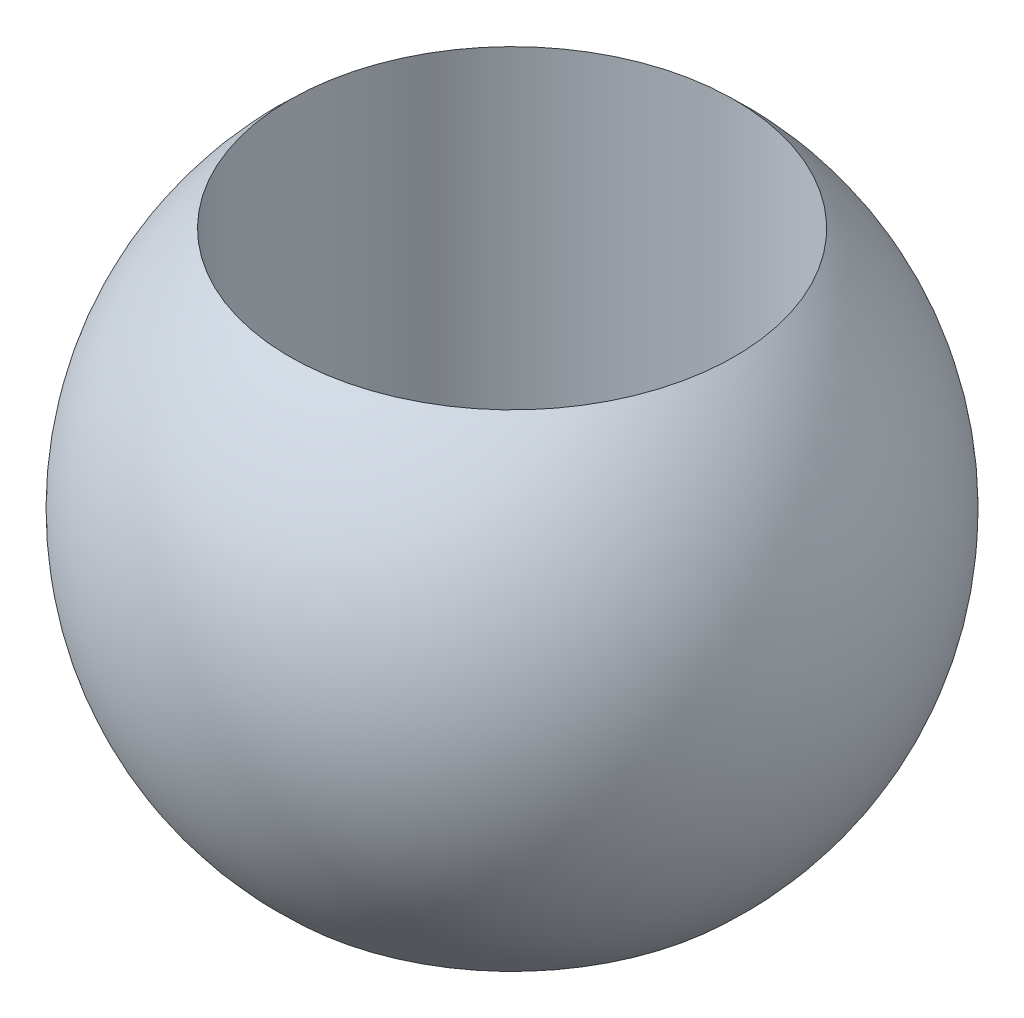
ISO-10303-21;
HEADER;
FILE_DESCRIPTION(('STEP AP214'),'2;1');
FILE_NAME('part.step','',(''),(''),'','','');
FILE_SCHEMA(('AUTOMOTIVE_DESIGN { 1 0 10303 214 1 1 1 1 }'));
ENDSEC;
DATA;
#1=APPLICATION_CONTEXT('core data for automotive mechanical design processes');
#2=APPLICATION_PROTOCOL_DEFINITION('international standard','automotive_design',2000,#1);
#3=PRODUCT_CONTEXT('',#1,'mechanical');
#4=PRODUCT('Part','Part','',(#3));
#5=PRODUCT_RELATED_PRODUCT_CATEGORY('part','',(#4));
#6=PRODUCT_DEFINITION_FORMATION('','',#4);
#7=PRODUCT_DEFINITION_CONTEXT('part definition',#1,'design');
#8=PRODUCT_DEFINITION('design','',#6,#7);
#9=PRODUCT_DEFINITION_SHAPE('','',#8);
#10=(LENGTH_UNIT() NAMED_UNIT(*) SI_UNIT(.MILLI.,.METRE.));
#11=(NAMED_UNIT(*) PLANE_ANGLE_UNIT() SI_UNIT($,.RADIAN.));
#12=(NAMED_UNIT(*) SI_UNIT($,.STERADIAN.) SOLID_ANGLE_UNIT());
#13=UNCERTAINTY_MEASURE_WITH_UNIT(LENGTH_MEASURE(1.E-05),#10,'distance_accuracy_value','');
#14=(GEOMETRIC_REPRESENTATION_CONTEXT(3) GLOBAL_UNCERTAINTY_ASSIGNED_CONTEXT((#13)) GLOBAL_UNIT_ASSIGNED_CONTEXT((#10,
#11,#12)) REPRESENTATION_CONTEXT('',''));
#15=CARTESIAN_POINT('',(0.,0.,0.));
#16=DIRECTION('',(0.,0.,1.));
#17=DIRECTION('',(1.,0.,0.));
#18=AXIS2_PLACEMENT_3D('',#15,#16,#17);
#19=CARTESIAN_POINT('',(0.,0.,0.));
#20=DIRECTION('',(0.,1.,0.));
#21=DIRECTION('',(1.,0.,0.));
#22=AXIS2_PLACEMENT_3D('',#19,#20,#21);
#23=SPHERICAL_SURFACE('',#22,2.032);
#24=CARTESIAN_POINT('',(0.,-1.49924562363877,0.));
#25=DIRECTION('',(0.,1.,0.));
#26=DIRECTION('',(-1.,0.,0.));
#27=AXIS2_PLACEMENT_3D('',#24,#25,#26);
#28=CIRCLE('',#27,1.3716);
#29=CARTESIAN_POINT('',(-1.3716,-1.49924562363877,0.));
#30=VERTEX_POINT('',#29);
#31=EDGE_CURVE('E39',#30,#30,#28,.T.);
#32=ORIENTED_EDGE('',*,*,#31,.T.);
#33=EDGE_LOOP('',(#32));
#34=FACE_BOUND('',#33,.T.);
#35=CARTESIAN_POINT('',(0.,1.49924562363877,0.));
#36=DIRECTION('',(0.,1.,0.));
#37=DIRECTION('',(-1.,0.,0.));
#38=AXIS2_PLACEMENT_3D('',#35,#36,#37);
#39=CIRCLE('',#38,1.3716);
#40=CARTESIAN_POINT('',(-1.3716,1.49924562363877,0.));
#41=VERTEX_POINT('',#40);
#42=EDGE_CURVE('E10',#41,#41,#39,.T.);
#43=ORIENTED_EDGE('',*,*,#42,.F.);
#44=EDGE_LOOP('',(#43));
#45=FACE_BOUND('',#44,.T.);
#46=ADVANCED_FACE('F33',(#34,#45),#23,.T.);
#47=CARTESIAN_POINT('',(0.,2.032,0.));
#48=DIRECTION('',(0.,1.,0.));
#49=DIRECTION('',(-1.,0.,0.));
#50=AXIS2_PLACEMENT_3D('',#47,#48,#49);
#51=CYLINDRICAL_SURFACE('',#50,1.3716);
#52=ORIENTED_EDGE('',*,*,#31,.F.);
#53=EDGE_LOOP('',(#52));
#54=FACE_BOUND('',#53,.T.);
#55=ORIENTED_EDGE('',*,*,#42,.T.);
#56=EDGE_LOOP('',(#55));
#57=FACE_BOUND('',#56,.T.);
#58=ADVANCED_FACE('F47',(#54,#57),#51,.F.);
#59=CLOSED_SHELL('',(#46,#58));
#60=MANIFOLD_SOLID_BREP('B2',#59);
#61=ADVANCED_BREP_SHAPE_REPRESENTATION('',(#18,#60),#14);
#62=SHAPE_DEFINITION_REPRESENTATION(#9,#61);
ENDSEC;
END-ISO-10303-21;
